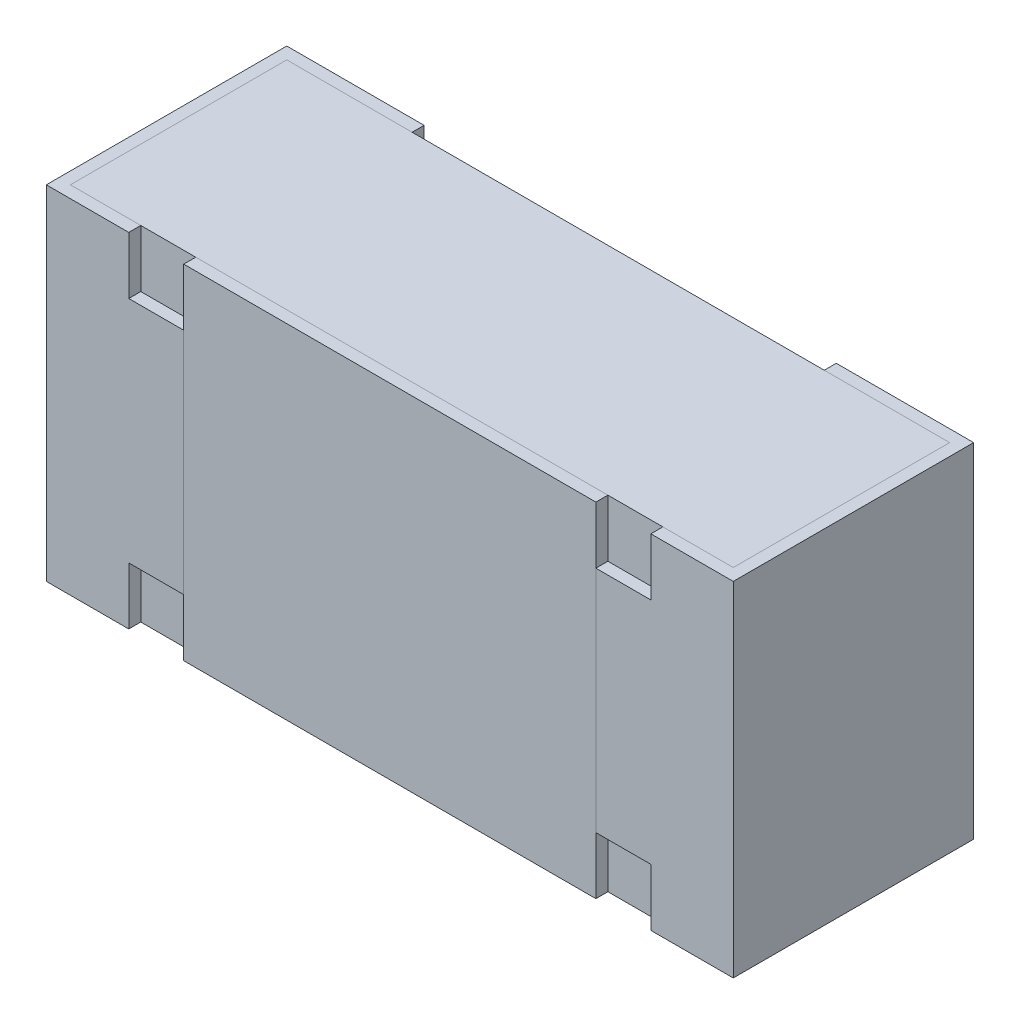
ISO-10303-21;
HEADER;
FILE_DESCRIPTION(('STEP AP214'),'2;1');
FILE_NAME('part.step','',(''),(''),'','','');
FILE_SCHEMA(('AUTOMOTIVE_DESIGN { 1 0 10303 214 1 1 1 1 }'));
ENDSEC;
DATA;
#1=APPLICATION_CONTEXT('core data for automotive mechanical design processes');
#2=APPLICATION_PROTOCOL_DEFINITION('international standard','automotive_design',2000,#1);
#3=PRODUCT_CONTEXT('',#1,'mechanical');
#4=PRODUCT('Part','Part','',(#3));
#5=PRODUCT_RELATED_PRODUCT_CATEGORY('part','',(#4));
#6=PRODUCT_DEFINITION_FORMATION('','',#4);
#7=PRODUCT_DEFINITION_CONTEXT('part definition',#1,'design');
#8=PRODUCT_DEFINITION('design','',#6,#7);
#9=PRODUCT_DEFINITION_SHAPE('','',#8);
#10=(LENGTH_UNIT() NAMED_UNIT(*) SI_UNIT(.MILLI.,.METRE.));
#11=(NAMED_UNIT(*) PLANE_ANGLE_UNIT() SI_UNIT($,.RADIAN.));
#12=(NAMED_UNIT(*) SI_UNIT($,.STERADIAN.) SOLID_ANGLE_UNIT());
#13=UNCERTAINTY_MEASURE_WITH_UNIT(LENGTH_MEASURE(1.E-05),#10,'distance_accuracy_value','');
#14=(GEOMETRIC_REPRESENTATION_CONTEXT(3) GLOBAL_UNCERTAINTY_ASSIGNED_CONTEXT((#13)) GLOBAL_UNIT_ASSIGNED_CONTEXT((#10,
#11,#12)) REPRESENTATION_CONTEXT('',''));
#15=CARTESIAN_POINT('',(0.,0.,0.));
#16=DIRECTION('',(0.,0.,1.));
#17=DIRECTION('',(1.,0.,0.));
#18=AXIS2_PLACEMENT_3D('',#15,#16,#17);
#19=CARTESIAN_POINT('',(0.000116839999999969,-0.24995428,0.01278128));
#20=DIRECTION('',(0.,-1.,0.));
#21=DIRECTION('',(1.,0.,0.));
#22=AXIS2_PLACEMENT_3D('',#19,#20,#21);
#23=PLANE('',#22);
#24=DIRECTION('',(0.,0.,-1.));
#25=VECTOR('',#24,1.);
#26=CARTESIAN_POINT('',(0.48261684,-0.24995428,0.03028128));
#27=LINE('',#26,#25);
#28=CARTESIAN_POINT('',(0.48261684,-0.24995428,0.34528128));
#29=VERTEX_POINT('',#28);
#30=CARTESIAN_POINT('',(0.48261684,-0.24995428,0.03028128));
#31=VERTEX_POINT('',#30);
#32=EDGE_CURVE('P0_E10',#29,#31,#27,.T.);
#33=ORIENTED_EDGE('',*,*,#32,.F.);
#34=DIRECTION('',(1.,0.,0.));
#35=VECTOR('',#34,1.);
#36=CARTESIAN_POINT('',(0.48261684,-0.24995428,0.34528128));
#37=LINE('',#36,#35);
#38=CARTESIAN_POINT('',(-0.48238316,-0.24995428,0.34528128));
#39=VERTEX_POINT('',#38);
#40=EDGE_CURVE('P0_E23',#39,#29,#37,.T.);
#41=ORIENTED_EDGE('',*,*,#40,.F.);
#42=DIRECTION('',(0.,0.,1.));
#43=VECTOR('',#42,1.);
#44=CARTESIAN_POINT('',(-0.48238316,-0.24995428,0.03028128));
#45=LINE('',#44,#43);
#46=CARTESIAN_POINT('',(-0.48238316,-0.24995428,0.03028128));
#47=VERTEX_POINT('',#46);
#48=EDGE_CURVE('P0_E69',#47,#39,#45,.T.);
#49=ORIENTED_EDGE('',*,*,#48,.F.);
#50=DIRECTION('',(-1.,0.,0.));
#51=VECTOR('',#50,1.);
#52=CARTESIAN_POINT('',(0.48261684,-0.24995428,0.03028128));
#53=LINE('',#52,#51);
#54=EDGE_CURVE('P0_E83',#31,#47,#53,.T.);
#55=ORIENTED_EDGE('',*,*,#54,.F.);
#56=EDGE_LOOP('',(#33,#41,#49,#55));
#57=FACE_BOUND('',#56,.T.);
#58=ADVANCED_FACE('P0_F16',(#57),#23,.T.);
#59=CARTESIAN_POINT('',(0.000116840000000031,0.25004572,0.01278128));
#60=DIRECTION('',(0.,-1.,0.));
#61=DIRECTION('',(1.,0.,0.));
#62=AXIS2_PLACEMENT_3D('',#59,#60,#61);
#63=PLANE('',#62);
#64=DIRECTION('',(0.,0.,-1.));
#65=VECTOR('',#64,1.);
#66=CARTESIAN_POINT('',(0.48261684,0.25004572,0.03028128));
#67=LINE('',#66,#65);
#68=CARTESIAN_POINT('',(0.48261684,0.25004572,0.34528128));
#69=VERTEX_POINT('',#68);
#70=CARTESIAN_POINT('',(0.48261684,0.25004572,0.03028128));
#71=VERTEX_POINT('',#70);
#72=EDGE_CURVE('P0_E81',#69,#71,#67,.T.);
#73=ORIENTED_EDGE('',*,*,#72,.T.);
#74=DIRECTION('',(-1.,0.,0.));
#75=VECTOR('',#74,1.);
#76=CARTESIAN_POINT('',(0.48261684,0.25004572,0.03028128));
#77=LINE('',#76,#75);
#78=CARTESIAN_POINT('',(-0.48238316,0.25004572,0.03028128));
#79=VERTEX_POINT('',#78);
#80=EDGE_CURVE('P0_E60',#71,#79,#77,.T.);
#81=ORIENTED_EDGE('',*,*,#80,.T.);
#82=DIRECTION('',(0.,0.,1.));
#83=VECTOR('',#82,1.);
#84=CARTESIAN_POINT('',(-0.48238316,0.25004572,0.03028128));
#85=LINE('',#84,#83);
#86=CARTESIAN_POINT('',(-0.48238316,0.25004572,0.34528128));
#87=VERTEX_POINT('',#86);
#88=EDGE_CURVE('P0_E54',#79,#87,#85,.T.);
#89=ORIENTED_EDGE('',*,*,#88,.T.);
#90=DIRECTION('',(1.,0.,0.));
#91=VECTOR('',#90,1.);
#92=CARTESIAN_POINT('',(0.48261684,0.25004572,0.34528128));
#93=LINE('',#92,#91);
#94=EDGE_CURVE('P0_E58',#87,#69,#93,.T.);
#95=ORIENTED_EDGE('',*,*,#94,.T.);
#96=EDGE_LOOP('',(#73,#81,#89,#95));
#97=FACE_BOUND('',#96,.T.);
#98=ADVANCED_FACE('P0_F56',(#97),#63,.F.);
#99=CARTESIAN_POINT('',(0.48261684,-1.26506511138739,0.0302812799999999));
#100=DIRECTION('',(0.,0.,-1.));
#101=DIRECTION('',(-1.,0.,0.));
#102=AXIS2_PLACEMENT_3D('',#99,#100,#101);
#103=PLANE('',#102);
#104=DIRECTION('',(0.,1.,0.));
#105=VECTOR('',#104,1.);
#106=CARTESIAN_POINT('',(0.48261684,-1.26506511138739,0.0302812799999999));
#107=LINE('',#106,#105);
#108=EDGE_CURVE('P0_E75',#31,#71,#107,.T.);
#109=ORIENTED_EDGE('',*,*,#108,.F.);
#110=ORIENTED_EDGE('',*,*,#54,.T.);
#111=DIRECTION('',(0.,1.,0.));
#112=VECTOR('',#111,1.);
#113=CARTESIAN_POINT('',(-0.48238316,-1.26506511138739,0.0302812799999999));
#114=LINE('',#113,#112);
#115=EDGE_CURVE('P0_E70',#47,#79,#114,.T.);
#116=ORIENTED_EDGE('',*,*,#115,.T.);
#117=ORIENTED_EDGE('',*,*,#80,.F.);
#118=EDGE_LOOP('',(#109,#110,#116,#117));
#119=FACE_BOUND('',#118,.T.);
#120=ADVANCED_FACE('P0_F87',(#119),#103,.T.);
#121=CARTESIAN_POINT('',(-0.48238316,-1.26506511138739,0.0302812799999999));
#122=DIRECTION('',(-1.,0.,0.));
#123=DIRECTION('',(0.,-1.,0.));
#124=AXIS2_PLACEMENT_3D('',#121,#122,#123);
#125=PLANE('',#124);
#126=ORIENTED_EDGE('',*,*,#115,.F.);
#127=ORIENTED_EDGE('',*,*,#48,.T.);
#128=DIRECTION('',(0.,1.,0.));
#129=VECTOR('',#128,1.);
#130=CARTESIAN_POINT('',(-0.48238316,-1.26506511138739,0.34528128));
#131=LINE('',#130,#129);
#132=EDGE_CURVE('P0_E66',#39,#87,#131,.T.);
#133=ORIENTED_EDGE('',*,*,#132,.T.);
#134=ORIENTED_EDGE('',*,*,#88,.F.);
#135=EDGE_LOOP('',(#126,#127,#133,#134));
#136=FACE_BOUND('',#135,.T.);
#137=ADVANCED_FACE('P0_F67',(#136),#125,.T.);
#138=CARTESIAN_POINT('',(0.48261684,-1.26506511138739,0.34528128));
#139=DIRECTION('',(0.,0.,1.));
#140=DIRECTION('',(0.,1.,0.));
#141=AXIS2_PLACEMENT_3D('',#138,#139,#140);
#142=PLANE('',#141);
#143=ORIENTED_EDGE('',*,*,#132,.F.);
#144=ORIENTED_EDGE('',*,*,#40,.T.);
#145=DIRECTION('',(0.,1.,0.));
#146=VECTOR('',#145,1.);
#147=CARTESIAN_POINT('',(0.48261684,-1.26506511138739,0.34528128));
#148=LINE('',#147,#146);
#149=EDGE_CURVE('P0_E71',#29,#69,#148,.T.);
#150=ORIENTED_EDGE('',*,*,#149,.T.);
#151=ORIENTED_EDGE('',*,*,#94,.F.);
#152=EDGE_LOOP('',(#143,#144,#150,#151));
#153=FACE_BOUND('',#152,.T.);
#154=ADVANCED_FACE('P0_F73',(#153),#142,.T.);
#155=CARTESIAN_POINT('',(0.48261684,-1.26506511138739,0.0302812799999999));
#156=DIRECTION('',(1.,0.,0.));
#157=DIRECTION('',(0.,0.,-1.));
#158=AXIS2_PLACEMENT_3D('',#155,#156,#157);
#159=PLANE('',#158);
#160=ORIENTED_EDGE('',*,*,#149,.F.);
#161=ORIENTED_EDGE('',*,*,#32,.T.);
#162=ORIENTED_EDGE('',*,*,#108,.T.);
#163=ORIENTED_EDGE('',*,*,#72,.F.);
#164=EDGE_LOOP('',(#160,#161,#162,#163));
#165=FACE_BOUND('',#164,.T.);
#166=ADVANCED_FACE('P0_F90',(#165),#159,.T.);
#167=CLOSED_SHELL('',(#58,#98,#120,#137,#154,#166));
#168=MANIFOLD_SOLID_BREP('P0_B1',#167);
#169=CARTESIAN_POINT('',(0.30011684,-0.24995428,-0.435743687590665));
#170=DIRECTION('',(1.,0.,0.));
#171=DIRECTION('',(0.,1.,0.));
#172=AXIS2_PLACEMENT_3D('',#169,#170,#171);
#173=PLANE('',#172);
#174=DIRECTION('',(0.,-1.,0.));
#175=VECTOR('',#174,1.);
#176=CARTESIAN_POINT('',(0.30011684,-0.24995428,0.34528128));
#177=LINE('',#176,#175);
#178=CARTESIAN_POINT('',(0.30011684,0.25004572,0.34528128));
#179=VERTEX_POINT('',#178);
#180=CARTESIAN_POINT('',(0.30011684,-0.24995428,0.34528128));
#181=VERTEX_POINT('',#180);
#182=EDGE_CURVE('P1_E11',#179,#181,#177,.T.);
#183=ORIENTED_EDGE('',*,*,#182,.F.);
#184=DIRECTION('',(0.,0.,1.));
#185=VECTOR('',#184,1.);
#186=CARTESIAN_POINT('',(0.30011684,0.25004572,-0.435743687590665));
#187=LINE('',#186,#185);
#188=CARTESIAN_POINT('',(0.30011684,0.25004572,0.36278128));
#189=VERTEX_POINT('',#188);
#190=EDGE_CURVE('P1_E24',#179,#189,#187,.T.);
#191=ORIENTED_EDGE('',*,*,#190,.T.);
#192=DIRECTION('',(0.,1.,0.));
#193=VECTOR('',#192,1.);
#194=CARTESIAN_POINT('',(0.30011684,-0.24995428,0.36278128));
#195=LINE('',#194,#193);
#196=CARTESIAN_POINT('',(0.30011684,-0.24995428,0.36278128));
#197=VERTEX_POINT('',#196);
#198=EDGE_CURVE('P1_E76',#197,#189,#195,.T.);
#199=ORIENTED_EDGE('',*,*,#198,.F.);
#200=DIRECTION('',(0.,0.,1.));
#201=VECTOR('',#200,1.);
#202=CARTESIAN_POINT('',(0.30011684,-0.24995428,-0.435743687590665));
#203=LINE('',#202,#201);
#204=EDGE_CURVE('P1_E86',#181,#197,#203,.T.);
#205=ORIENTED_EDGE('',*,*,#204,.F.);
#206=EDGE_LOOP('',(#183,#191,#199,#205));
#207=FACE_BOUND('',#206,.T.);
#208=ADVANCED_FACE('P1_F17',(#207),#173,.T.);
#209=CARTESIAN_POINT('',(0.30011684,-0.24995428,-0.435743687590665));
#210=DIRECTION('',(0.,-1.,0.));
#211=DIRECTION('',(1.,0.,0.));
#212=AXIS2_PLACEMENT_3D('',#209,#210,#211);
#213=PLANE('',#212);
#214=DIRECTION('',(-1.,0.,0.));
#215=VECTOR('',#214,1.);
#216=CARTESIAN_POINT('',(0.30011684,-0.24995428,0.34528128));
#217=LINE('',#216,#215);
#218=CARTESIAN_POINT('',(-0.29988316,-0.24995428,0.34528128));
#219=VERTEX_POINT('',#218);
#220=EDGE_CURVE('P1_E84',#181,#219,#217,.T.);
#221=ORIENTED_EDGE('',*,*,#220,.F.);
#222=ORIENTED_EDGE('',*,*,#204,.T.);
#223=DIRECTION('',(1.,0.,0.));
#224=VECTOR('',#223,1.);
#225=CARTESIAN_POINT('',(0.30011684,-0.24995428,0.36278128));
#226=LINE('',#225,#224);
#227=CARTESIAN_POINT('',(-0.29988316,-0.24995428,0.36278128));
#228=VERTEX_POINT('',#227);
#229=EDGE_CURVE('P1_E82',#228,#197,#226,.T.);
#230=ORIENTED_EDGE('',*,*,#229,.F.);
#231=DIRECTION('',(0.,0.,1.));
#232=VECTOR('',#231,1.);
#233=CARTESIAN_POINT('',(-0.29988316,-0.24995428,-0.435743687590665));
#234=LINE('',#233,#232);
#235=EDGE_CURVE('P1_E67',#219,#228,#234,.T.);
#236=ORIENTED_EDGE('',*,*,#235,.F.);
#237=EDGE_LOOP('',(#221,#222,#230,#236));
#238=FACE_BOUND('',#237,.T.);
#239=ADVANCED_FACE('P1_F91',(#238),#213,.T.);
#240=CARTESIAN_POINT('',(-0.29988316,-0.24995428,-0.435743687590665));
#241=DIRECTION('',(-1.,0.,0.));
#242=DIRECTION('',(0.,-1.,0.));
#243=AXIS2_PLACEMENT_3D('',#240,#241,#242);
#244=PLANE('',#243);
#245=DIRECTION('',(0.,1.,0.));
#246=VECTOR('',#245,1.);
#247=CARTESIAN_POINT('',(-0.29988316,-0.24995428,0.34528128));
#248=LINE('',#247,#246);
#249=CARTESIAN_POINT('',(-0.29988316,0.25004572,0.34528128));
#250=VERTEX_POINT('',#249);
#251=EDGE_CURVE('P1_E71',#219,#250,#248,.T.);
#252=ORIENTED_EDGE('',*,*,#251,.F.);
#253=ORIENTED_EDGE('',*,*,#235,.T.);
#254=DIRECTION('',(0.,-1.,0.));
#255=VECTOR('',#254,1.);
#256=CARTESIAN_POINT('',(-0.29988316,-0.24995428,0.36278128));
#257=LINE('',#256,#255);
#258=CARTESIAN_POINT('',(-0.29988316,0.25004572,0.36278128));
#259=VERTEX_POINT('',#258);
#260=EDGE_CURVE('P1_E63',#259,#228,#257,.T.);
#261=ORIENTED_EDGE('',*,*,#260,.F.);
#262=DIRECTION('',(0.,0.,1.));
#263=VECTOR('',#262,1.);
#264=CARTESIAN_POINT('',(-0.29988316,0.25004572,-0.435743687590665));
#265=LINE('',#264,#263);
#266=EDGE_CURVE('P1_E55',#250,#259,#265,.T.);
#267=ORIENTED_EDGE('',*,*,#266,.F.);
#268=EDGE_LOOP('',(#252,#253,#261,#267));
#269=FACE_BOUND('',#268,.T.);
#270=ADVANCED_FACE('P1_F66',(#269),#244,.T.);
#271=CARTESIAN_POINT('',(0.30011684,0.25004572,-0.435743687590665));
#272=DIRECTION('',(0.,1.,0.));
#273=DIRECTION('',(-1.,0.,0.));
#274=AXIS2_PLACEMENT_3D('',#271,#272,#273);
#275=PLANE('',#274);
#276=DIRECTION('',(1.,0.,0.));
#277=VECTOR('',#276,1.);
#278=CARTESIAN_POINT('',(0.30011684,0.25004572,0.34528128));
#279=LINE('',#278,#277);
#280=EDGE_CURVE('P1_E60',#250,#179,#279,.T.);
#281=ORIENTED_EDGE('',*,*,#280,.F.);
#282=ORIENTED_EDGE('',*,*,#266,.T.);
#283=DIRECTION('',(-1.,0.,0.));
#284=VECTOR('',#283,1.);
#285=CARTESIAN_POINT('',(0.30011684,0.25004572,0.36278128));
#286=LINE('',#285,#284);
#287=EDGE_CURVE('P1_E59',#189,#259,#286,.T.);
#288=ORIENTED_EDGE('',*,*,#287,.F.);
#289=ORIENTED_EDGE('',*,*,#190,.F.);
#290=EDGE_LOOP('',(#281,#282,#288,#289));
#291=FACE_BOUND('',#290,.T.);
#292=ADVANCED_FACE('P1_F57',(#291),#275,.T.);
#293=CARTESIAN_POINT('',(0.000116839999999937,4.57199999999786E-05,0.36278128));
#294=DIRECTION('',(0.,0.,1.));
#295=DIRECTION('',(1.,0.,0.));
#296=AXIS2_PLACEMENT_3D('',#293,#294,#295);
#297=PLANE('',#296);
#298=ORIENTED_EDGE('',*,*,#198,.T.);
#299=ORIENTED_EDGE('',*,*,#287,.T.);
#300=ORIENTED_EDGE('',*,*,#260,.T.);
#301=ORIENTED_EDGE('',*,*,#229,.T.);
#302=EDGE_LOOP('',(#298,#299,#300,#301));
#303=FACE_BOUND('',#302,.T.);
#304=ADVANCED_FACE('P1_F74',(#303),#297,.T.);
#305=CARTESIAN_POINT('',(0.48261684,-1.26506511138739,0.34528128));
#306=DIRECTION('',(0.,0.,1.));
#307=DIRECTION('',(0.,1.,0.));
#308=AXIS2_PLACEMENT_3D('',#305,#306,#307);
#309=PLANE('',#308);
#310=ORIENTED_EDGE('',*,*,#182,.T.);
#311=ORIENTED_EDGE('',*,*,#220,.T.);
#312=ORIENTED_EDGE('',*,*,#251,.T.);
#313=ORIENTED_EDGE('',*,*,#280,.T.);
#314=EDGE_LOOP('',(#310,#311,#312,#313));
#315=FACE_BOUND('',#314,.T.);
#316=ADVANCED_FACE('P1_F88',(#315),#309,.F.);
#317=CLOSED_SHELL('',(#208,#239,#270,#292,#304,#316));
#318=MANIFOLD_SOLID_BREP('P1_B1',#317);
#319=CARTESIAN_POINT('',(0.30011684,0.25004572,0.03028128));
#320=DIRECTION('',(1.,0.,0.));
#321=DIRECTION('',(0.,1.,0.));
#322=AXIS2_PLACEMENT_3D('',#319,#320,#321);
#323=PLANE('',#322);
#324=DIRECTION('',(0.,0.,1.));
#325=VECTOR('',#324,1.);
#326=CARTESIAN_POINT('',(0.30011684,-0.24995428,0.03028128));
#327=LINE('',#326,#325);
#328=CARTESIAN_POINT('',(0.30011684,-0.24995428,0.01278128));
#329=VERTEX_POINT('',#328);
#330=CARTESIAN_POINT('',(0.30011684,-0.24995428,0.03028128));
#331=VERTEX_POINT('',#330);
#332=EDGE_CURVE('P2_E11',#329,#331,#327,.T.);
#333=ORIENTED_EDGE('',*,*,#332,.T.);
#334=DIRECTION('',(0.,-1.,0.));
#335=VECTOR('',#334,1.);
#336=CARTESIAN_POINT('',(0.30011684,0.25004572,0.03028128));
#337=LINE('',#336,#335);
#338=CARTESIAN_POINT('',(0.30011684,0.25004572,0.03028128));
#339=VERTEX_POINT('',#338);
#340=EDGE_CURVE('P2_E24',#339,#331,#337,.T.);
#341=ORIENTED_EDGE('',*,*,#340,.F.);
#342=DIRECTION('',(0.,0.,1.));
#343=VECTOR('',#342,1.);
#344=CARTESIAN_POINT('',(0.30011684,0.25004572,0.03028128));
#345=LINE('',#344,#343);
#346=CARTESIAN_POINT('',(0.30011684,0.25004572,0.01278128));
#347=VERTEX_POINT('',#346);
#348=EDGE_CURVE('P2_E189',#347,#339,#345,.T.);
#349=ORIENTED_EDGE('',*,*,#348,.F.);
#350=DIRECTION('',(0.,-1.,0.));
#351=VECTOR('',#350,1.);
#352=CARTESIAN_POINT('',(0.30011684,0.25004572,0.01278128));
#353=LINE('',#352,#351);
#354=EDGE_CURVE('P2_E109',#347,#329,#353,.T.);
#355=ORIENTED_EDGE('',*,*,#354,.T.);
#356=EDGE_LOOP('',(#333,#341,#349,#355));
#357=FACE_BOUND('',#356,.T.);
#358=ADVANCED_FACE('P2_F17',(#357),#323,.F.);
#359=CARTESIAN_POINT('',(0.30011684,0.25004572,0.03028128));
#360=DIRECTION('',(0.,0.,-1.));
#361=DIRECTION('',(-1.,0.,0.));
#362=AXIS2_PLACEMENT_3D('',#359,#360,#361);
#363=PLANE('',#362);
#364=DIRECTION('',(1.,0.,0.));
#365=VECTOR('',#364,1.);
#366=CARTESIAN_POINT('',(0.30011684,-0.24995428,0.03028128));
#367=LINE('',#366,#365);
#368=CARTESIAN_POINT('',(0.48261684,-0.24995428,0.03028128));
#369=VERTEX_POINT('',#368);
#370=EDGE_CURVE('P2_E186',#331,#369,#367,.T.);
#371=ORIENTED_EDGE('',*,*,#370,.T.);
#372=DIRECTION('',(0.,-1.,0.));
#373=VECTOR('',#372,1.);
#374=CARTESIAN_POINT('',(0.48261684,0.25004572,0.03028128));
#375=LINE('',#374,#373);
#376=CARTESIAN_POINT('',(0.48261684,0.25004572,0.03028128));
#377=VERTEX_POINT('',#376);
#378=EDGE_CURVE('P2_E183',#377,#369,#375,.T.);
#379=ORIENTED_EDGE('',*,*,#378,.F.);
#380=DIRECTION('',(1.,0.,0.));
#381=VECTOR('',#380,1.);
#382=CARTESIAN_POINT('',(0.30011684,0.25004572,0.03028128));
#383=LINE('',#382,#381);
#384=EDGE_CURVE('P2_E180',#339,#377,#383,.T.);
#385=ORIENTED_EDGE('',*,*,#384,.F.);
#386=ORIENTED_EDGE('',*,*,#340,.T.);
#387=EDGE_LOOP('',(#371,#379,#385,#386));
#388=FACE_BOUND('',#387,.T.);
#389=ADVANCED_FACE('P2_F192',(#388),#363,.F.);
#390=CARTESIAN_POINT('',(0.48261684,0.25004572,0.03028128));
#391=DIRECTION('',(1.,0.,0.));
#392=DIRECTION('',(0.,1.,0.));
#393=AXIS2_PLACEMENT_3D('',#390,#391,#392);
#394=PLANE('',#393);
#395=DIRECTION('',(0.,0.,1.));
#396=VECTOR('',#395,1.);
#397=CARTESIAN_POINT('',(0.48261684,-0.24995428,0.03028128));
#398=LINE('',#397,#396);
#399=CARTESIAN_POINT('',(0.48261684,-0.24995428,0.34528128));
#400=VERTEX_POINT('',#399);
#401=EDGE_CURVE('P2_E178',#369,#400,#398,.T.);
#402=ORIENTED_EDGE('',*,*,#401,.T.);
#403=DIRECTION('',(0.,-1.,0.));
#404=VECTOR('',#403,1.);
#405=CARTESIAN_POINT('',(0.48261684,0.25004572,0.34528128));
#406=LINE('',#405,#404);
#407=CARTESIAN_POINT('',(0.48261684,0.25004572,0.34528128));
#408=VERTEX_POINT('',#407);
#409=EDGE_CURVE('P2_E175',#408,#400,#406,.T.);
#410=ORIENTED_EDGE('',*,*,#409,.F.);
#411=DIRECTION('',(0.,0.,1.));
#412=VECTOR('',#411,1.);
#413=CARTESIAN_POINT('',(0.48261684,0.25004572,0.03028128));
#414=LINE('',#413,#412);
#415=EDGE_CURVE('P2_E173',#377,#408,#414,.T.);
#416=ORIENTED_EDGE('',*,*,#415,.F.);
#417=ORIENTED_EDGE('',*,*,#378,.T.);
#418=EDGE_LOOP('',(#402,#410,#416,#417));
#419=FACE_BOUND('',#418,.T.);
#420=ADVANCED_FACE('P2_F200',(#419),#394,.F.);
#421=CARTESIAN_POINT('',(0.48261684,0.25004572,0.34528128));
#422=DIRECTION('',(0.,0.,1.));
#423=DIRECTION('',(0.,1.,0.));
#424=AXIS2_PLACEMENT_3D('',#421,#422,#423);
#425=PLANE('',#424);
#426=DIRECTION('',(1.,0.,0.));
#427=VECTOR('',#426,1.);
#428=CARTESIAN_POINT('',(0.30011684,0.166712386666667,0.34528128));
#429=LINE('',#428,#427);
#430=CARTESIAN_POINT('',(0.30011684,0.166712386666667,0.34528128));
#431=VERTEX_POINT('',#430);
#432=CARTESIAN_POINT('',(0.38011684,0.166712386666667,0.34528128));
#433=VERTEX_POINT('',#432);
#434=EDGE_CURVE('P2_E171',#431,#433,#429,.T.);
#435=ORIENTED_EDGE('',*,*,#434,.T.);
#436=DIRECTION('',(0.,1.,0.));
#437=VECTOR('',#436,1.);
#438=CARTESIAN_POINT('',(0.38011684,0.25004572,0.34528128));
#439=LINE('',#438,#437);
#440=CARTESIAN_POINT('',(0.38011684,0.25004572,0.34528128));
#441=VERTEX_POINT('',#440);
#442=EDGE_CURVE('P2_E168',#433,#441,#439,.T.);
#443=ORIENTED_EDGE('',*,*,#442,.T.);
#444=DIRECTION('',(-1.,0.,0.));
#445=VECTOR('',#444,1.);
#446=CARTESIAN_POINT('',(0.48261684,0.25004572,0.34528128));
#447=LINE('',#446,#445);
#448=EDGE_CURVE('P2_E166',#408,#441,#447,.T.);
#449=ORIENTED_EDGE('',*,*,#448,.F.);
#450=ORIENTED_EDGE('',*,*,#409,.T.);
#451=DIRECTION('',(-1.,0.,0.));
#452=VECTOR('',#451,1.);
#453=CARTESIAN_POINT('',(0.48261684,-0.24995428,0.34528128));
#454=LINE('',#453,#452);
#455=CARTESIAN_POINT('',(0.38011684,-0.24995428,0.34528128));
#456=VERTEX_POINT('',#455);
#457=EDGE_CURVE('P2_E164',#400,#456,#454,.T.);
#458=ORIENTED_EDGE('',*,*,#457,.T.);
#459=DIRECTION('',(0.,1.,0.));
#460=VECTOR('',#459,1.);
#461=CARTESIAN_POINT('',(0.38011684,-0.24995428,0.34528128));
#462=LINE('',#461,#460);
#463=CARTESIAN_POINT('',(0.38011684,-0.166620946666667,0.34528128));
#464=VERTEX_POINT('',#463);
#465=EDGE_CURVE('P2_E161',#456,#464,#462,.T.);
#466=ORIENTED_EDGE('',*,*,#465,.T.);
#467=DIRECTION('',(-1.,0.,0.));
#468=VECTOR('',#467,1.);
#469=CARTESIAN_POINT('',(0.30011684,-0.166620946666667,0.34528128));
#470=LINE('',#469,#468);
#471=CARTESIAN_POINT('',(0.30011684,-0.166620946666667,0.34528128));
#472=VERTEX_POINT('',#471);
#473=EDGE_CURVE('P2_E158',#464,#472,#470,.T.);
#474=ORIENTED_EDGE('',*,*,#473,.T.);
#475=DIRECTION('',(0.,-1.,0.));
#476=VECTOR('',#475,1.);
#477=CARTESIAN_POINT('',(0.30011684,0.25004572,0.34528128));
#478=LINE('',#477,#476);
#479=EDGE_CURVE('P2_E155',#431,#472,#478,.T.);
#480=ORIENTED_EDGE('',*,*,#479,.F.);
#481=EDGE_LOOP('',(#435,#443,#449,#450,#458,#466,#474,#480));
#482=FACE_BOUND('',#481,.T.);
#483=ADVANCED_FACE('P2_F228',(#482),#425,.F.);
#484=CARTESIAN_POINT('',(0.30011684,0.25004572,0.36278128));
#485=DIRECTION('',(1.,0.,0.));
#486=DIRECTION('',(0.,1.,0.));
#487=AXIS2_PLACEMENT_3D('',#484,#485,#486);
#488=PLANE('',#487);
#489=DIRECTION('',(0.,-1.,0.));
#490=VECTOR('',#489,1.);
#491=CARTESIAN_POINT('',(0.30011684,0.25004572,0.36278128));
#492=LINE('',#491,#490);
#493=CARTESIAN_POINT('',(0.30011684,0.166712386666667,0.36278128));
#494=VERTEX_POINT('',#493);
#495=CARTESIAN_POINT('',(0.30011684,-0.166620946666667,0.36278128));
#496=VERTEX_POINT('',#495);
#497=EDGE_CURVE('P2_E152',#494,#496,#492,.T.);
#498=ORIENTED_EDGE('',*,*,#497,.F.);
#499=DIRECTION('',(0.,0.,1.));
#500=VECTOR('',#499,1.);
#501=CARTESIAN_POINT('',(0.30011684,0.166712386666667,0.34528128));
#502=LINE('',#501,#500);
#503=EDGE_CURVE('P2_E150',#431,#494,#502,.T.);
#504=ORIENTED_EDGE('',*,*,#503,.F.);
#505=ORIENTED_EDGE('',*,*,#479,.T.);
#506=DIRECTION('',(0.,0.,1.));
#507=VECTOR('',#506,1.);
#508=CARTESIAN_POINT('',(0.30011684,-0.166620946666667,0.34528128));
#509=LINE('',#508,#507);
#510=EDGE_CURVE('P2_E147',#472,#496,#509,.T.);
#511=ORIENTED_EDGE('',*,*,#510,.T.);
#512=EDGE_LOOP('',(#498,#504,#505,#511));
#513=FACE_BOUND('',#512,.T.);
#514=ADVANCED_FACE('P2_F232',(#513),#488,.F.);
#515=CARTESIAN_POINT('',(0.50011684,0.25004572,0.36278128));
#516=DIRECTION('',(0.,0.,-1.));
#517=DIRECTION('',(0.,-1.,0.));
#518=AXIS2_PLACEMENT_3D('',#515,#516,#517);
#519=PLANE('',#518);
#520=DIRECTION('',(1.,0.,0.));
#521=VECTOR('',#520,1.);
#522=CARTESIAN_POINT('',(0.50011684,0.25004572,0.36278128));
#523=LINE('',#522,#521);
#524=CARTESIAN_POINT('',(0.38011684,0.25004572,0.36278128));
#525=VERTEX_POINT('',#524);
#526=CARTESIAN_POINT('',(0.50011684,0.25004572,0.36278128));
#527=VERTEX_POINT('',#526);
#528=EDGE_CURVE('P2_E125',#525,#527,#523,.T.);
#529=ORIENTED_EDGE('',*,*,#528,.F.);
#530=DIRECTION('',(0.,1.,0.));
#531=VECTOR('',#530,1.);
#532=CARTESIAN_POINT('',(0.38011684,0.25004572,0.36278128));
#533=LINE('',#532,#531);
#534=CARTESIAN_POINT('',(0.38011684,0.166712386666667,0.36278128));
#535=VERTEX_POINT('',#534);
#536=EDGE_CURVE('P2_E143',#535,#525,#533,.T.);
#537=ORIENTED_EDGE('',*,*,#536,.F.);
#538=DIRECTION('',(1.,0.,0.));
#539=VECTOR('',#538,1.);
#540=CARTESIAN_POINT('',(0.30011684,0.166712386666667,0.36278128));
#541=LINE('',#540,#539);
#542=EDGE_CURVE('P2_E141',#494,#535,#541,.T.);
#543=ORIENTED_EDGE('',*,*,#542,.F.);
#544=ORIENTED_EDGE('',*,*,#497,.T.);
#545=DIRECTION('',(-1.,0.,0.));
#546=VECTOR('',#545,1.);
#547=CARTESIAN_POINT('',(0.30011684,-0.166620946666667,0.36278128));
#548=LINE('',#547,#546);
#549=CARTESIAN_POINT('',(0.38011684,-0.166620946666667,0.36278128));
#550=VERTEX_POINT('',#549);
#551=EDGE_CURVE('P2_E139',#550,#496,#548,.T.);
#552=ORIENTED_EDGE('',*,*,#551,.F.);
#553=DIRECTION('',(0.,1.,0.));
#554=VECTOR('',#553,1.);
#555=CARTESIAN_POINT('',(0.38011684,-0.24995428,0.36278128));
#556=LINE('',#555,#554);
#557=CARTESIAN_POINT('',(0.38011684,-0.24995428,0.36278128));
#558=VERTEX_POINT('',#557);
#559=EDGE_CURVE('P2_E136',#558,#550,#556,.T.);
#560=ORIENTED_EDGE('',*,*,#559,.F.);
#561=DIRECTION('',(1.,0.,0.));
#562=VECTOR('',#561,1.);
#563=CARTESIAN_POINT('',(0.50011684,-0.24995428,0.36278128));
#564=LINE('',#563,#562);
#565=CARTESIAN_POINT('',(0.50011684,-0.24995428,0.36278128));
#566=VERTEX_POINT('',#565);
#567=EDGE_CURVE('P2_E133',#558,#566,#564,.T.);
#568=ORIENTED_EDGE('',*,*,#567,.T.);
#569=DIRECTION('',(0.,-1.,0.));
#570=VECTOR('',#569,1.);
#571=CARTESIAN_POINT('',(0.50011684,0.25004572,0.36278128));
#572=LINE('',#571,#570);
#573=EDGE_CURVE('P2_E131',#527,#566,#572,.T.);
#574=ORIENTED_EDGE('',*,*,#573,.F.);
#575=EDGE_LOOP('',(#529,#537,#543,#544,#552,#560,#568,#574));
#576=FACE_BOUND('',#575,.T.);
#577=ADVANCED_FACE('P2_F204',(#576),#519,.F.);
#578=CARTESIAN_POINT('',(0.50011684,0.25004572,0.01278128));
#579=DIRECTION('',(-1.,0.,0.));
#580=DIRECTION('',(0.,-1.,0.));
#581=AXIS2_PLACEMENT_3D('',#578,#579,#580);
#582=PLANE('',#581);
#583=DIRECTION('',(0.,0.,-1.));
#584=VECTOR('',#583,1.);
#585=CARTESIAN_POINT('',(0.50011684,-0.24995428,0.0127812799999999));
#586=LINE('',#585,#584);
#587=CARTESIAN_POINT('',(0.50011684,-0.24995428,0.0127812799999999));
#588=VERTEX_POINT('',#587);
#589=EDGE_CURVE('P2_E120',#566,#588,#586,.T.);
#590=ORIENTED_EDGE('',*,*,#589,.T.);
#591=DIRECTION('',(0.,-1.,0.));
#592=VECTOR('',#591,1.);
#593=CARTESIAN_POINT('',(0.50011684,0.25004572,0.01278128));
#594=LINE('',#593,#592);
#595=CARTESIAN_POINT('',(0.50011684,0.25004572,0.01278128));
#596=VERTEX_POINT('',#595);
#597=EDGE_CURVE('P2_E108',#596,#588,#594,.T.);
#598=ORIENTED_EDGE('',*,*,#597,.F.);
#599=DIRECTION('',(0.,0.,-1.));
#600=VECTOR('',#599,1.);
#601=CARTESIAN_POINT('',(0.50011684,0.25004572,0.01278128));
#602=LINE('',#601,#600);
#603=EDGE_CURVE('P2_E119',#527,#596,#602,.T.);
#604=ORIENTED_EDGE('',*,*,#603,.F.);
#605=ORIENTED_EDGE('',*,*,#573,.T.);
#606=EDGE_LOOP('',(#590,#598,#604,#605));
#607=FACE_BOUND('',#606,.T.);
#608=ADVANCED_FACE('P2_F117',(#607),#582,.F.);
#609=CARTESIAN_POINT('',(0.30011684,0.25004572,0.01278128));
#610=DIRECTION('',(0.,0.,1.));
#611=DIRECTION('',(1.,0.,0.));
#612=AXIS2_PLACEMENT_3D('',#609,#610,#611);
#613=PLANE('',#612);
#614=DIRECTION('',(-1.,0.,0.));
#615=VECTOR('',#614,1.);
#616=CARTESIAN_POINT('',(0.30011684,-0.24995428,0.01278128));
#617=LINE('',#616,#615);
#618=EDGE_CURVE('P2_E112',#588,#329,#617,.T.);
#619=ORIENTED_EDGE('',*,*,#618,.T.);
#620=ORIENTED_EDGE('',*,*,#354,.F.);
#621=DIRECTION('',(-1.,0.,0.));
#622=VECTOR('',#621,1.);
#623=CARTESIAN_POINT('',(0.30011684,0.25004572,0.01278128));
#624=LINE('',#623,#622);
#625=EDGE_CURVE('P2_E104',#596,#347,#624,.T.);
#626=ORIENTED_EDGE('',*,*,#625,.F.);
#627=ORIENTED_EDGE('',*,*,#597,.T.);
#628=EDGE_LOOP('',(#619,#620,#626,#627));
#629=FACE_BOUND('',#628,.T.);
#630=ADVANCED_FACE('P2_F107',(#629),#613,.F.);
#631=CARTESIAN_POINT('',(0.000116840000000031,0.25004572,0.01278128));
#632=DIRECTION('',(0.,-1.,0.));
#633=DIRECTION('',(1.,0.,0.));
#634=AXIS2_PLACEMENT_3D('',#631,#632,#633);
#635=PLANE('',#634);
#636=ORIENTED_EDGE('',*,*,#448,.T.);
#637=DIRECTION('',(0.,0.,1.));
#638=VECTOR('',#637,1.);
#639=CARTESIAN_POINT('',(0.38011684,0.25004572,0.34528128));
#640=LINE('',#639,#638);
#641=EDGE_CURVE('P2_E113',#441,#525,#640,.T.);
#642=ORIENTED_EDGE('',*,*,#641,.T.);
#643=ORIENTED_EDGE('',*,*,#528,.T.);
#644=ORIENTED_EDGE('',*,*,#603,.T.);
#645=ORIENTED_EDGE('',*,*,#625,.T.);
#646=ORIENTED_EDGE('',*,*,#348,.T.);
#647=ORIENTED_EDGE('',*,*,#384,.T.);
#648=ORIENTED_EDGE('',*,*,#415,.T.);
#649=EDGE_LOOP('',(#636,#642,#643,#644,#645,#646,#647,#648));
#650=FACE_BOUND('',#649,.T.);
#651=ADVANCED_FACE('P2_F123',(#650),#635,.F.);
#652=CARTESIAN_POINT('',(0.000116839999999969,-0.24995428,0.01278128));
#653=DIRECTION('',(0.,-1.,0.));
#654=DIRECTION('',(1.,0.,0.));
#655=AXIS2_PLACEMENT_3D('',#652,#653,#654);
#656=PLANE('',#655);
#657=DIRECTION('',(0.,0.,1.));
#658=VECTOR('',#657,1.);
#659=CARTESIAN_POINT('',(0.38011684,-0.24995428,0.34528128));
#660=LINE('',#659,#658);
#661=EDGE_CURVE('P2_E209',#456,#558,#660,.T.);
#662=ORIENTED_EDGE('',*,*,#661,.F.);
#663=ORIENTED_EDGE('',*,*,#457,.F.);
#664=ORIENTED_EDGE('',*,*,#401,.F.);
#665=ORIENTED_EDGE('',*,*,#370,.F.);
#666=ORIENTED_EDGE('',*,*,#332,.F.);
#667=ORIENTED_EDGE('',*,*,#618,.F.);
#668=ORIENTED_EDGE('',*,*,#589,.F.);
#669=ORIENTED_EDGE('',*,*,#567,.F.);
#670=EDGE_LOOP('',(#662,#663,#664,#665,#666,#667,#668,#669));
#671=FACE_BOUND('',#670,.T.);
#672=ADVANCED_FACE('P2_F196',(#671),#656,.T.);
#673=CARTESIAN_POINT('',(0.30011684,-0.166620946666667,0.34528128));
#674=DIRECTION('',(0.,1.,0.));
#675=DIRECTION('',(-1.,0.,0.));
#676=AXIS2_PLACEMENT_3D('',#673,#674,#675);
#677=PLANE('',#676);
#678=ORIENTED_EDGE('',*,*,#551,.T.);
#679=ORIENTED_EDGE('',*,*,#510,.F.);
#680=ORIENTED_EDGE('',*,*,#473,.F.);
#681=DIRECTION('',(0.,0.,1.));
#682=VECTOR('',#681,1.);
#683=CARTESIAN_POINT('',(0.38011684,-0.166620946666667,0.34528128));
#684=LINE('',#683,#682);
#685=EDGE_CURVE('P2_E211',#464,#550,#684,.T.);
#686=ORIENTED_EDGE('',*,*,#685,.T.);
#687=EDGE_LOOP('',(#678,#679,#680,#686));
#688=FACE_BOUND('',#687,.T.);
#689=ADVANCED_FACE('P2_F235',(#688),#677,.F.);
#690=CARTESIAN_POINT('',(0.38011684,-0.24995428,0.34528128));
#691=DIRECTION('',(1.,0.,0.));
#692=DIRECTION('',(0.,0.,-1.));
#693=AXIS2_PLACEMENT_3D('',#690,#691,#692);
#694=PLANE('',#693);
#695=ORIENTED_EDGE('',*,*,#559,.T.);
#696=ORIENTED_EDGE('',*,*,#685,.F.);
#697=ORIENTED_EDGE('',*,*,#465,.F.);
#698=ORIENTED_EDGE('',*,*,#661,.T.);
#699=EDGE_LOOP('',(#695,#696,#697,#698));
#700=FACE_BOUND('',#699,.T.);
#701=ADVANCED_FACE('P2_F210',(#700),#694,.F.);
#702=CARTESIAN_POINT('',(0.38011684,0.25004572,0.34528128));
#703=DIRECTION('',(1.,0.,0.));
#704=DIRECTION('',(0.,0.,-1.));
#705=AXIS2_PLACEMENT_3D('',#702,#703,#704);
#706=PLANE('',#705);
#707=ORIENTED_EDGE('',*,*,#536,.T.);
#708=ORIENTED_EDGE('',*,*,#641,.F.);
#709=ORIENTED_EDGE('',*,*,#442,.F.);
#710=DIRECTION('',(0.,0.,1.));
#711=VECTOR('',#710,1.);
#712=CARTESIAN_POINT('',(0.38011684,0.166712386666667,0.34528128));
#713=LINE('',#712,#711);
#714=EDGE_CURVE('P2_E214',#433,#535,#713,.T.);
#715=ORIENTED_EDGE('',*,*,#714,.T.);
#716=EDGE_LOOP('',(#707,#708,#709,#715));
#717=FACE_BOUND('',#716,.T.);
#718=ADVANCED_FACE('P2_F222',(#717),#706,.F.);
#719=CARTESIAN_POINT('',(0.30011684,0.166712386666667,0.34528128));
#720=DIRECTION('',(0.,-1.,0.));
#721=DIRECTION('',(1.,0.,0.));
#722=AXIS2_PLACEMENT_3D('',#719,#720,#721);
#723=PLANE('',#722);
#724=ORIENTED_EDGE('',*,*,#542,.T.);
#725=ORIENTED_EDGE('',*,*,#714,.F.);
#726=ORIENTED_EDGE('',*,*,#434,.F.);
#727=ORIENTED_EDGE('',*,*,#503,.T.);
#728=EDGE_LOOP('',(#724,#725,#726,#727));
#729=FACE_BOUND('',#728,.T.);
#730=ADVANCED_FACE('P2_F230',(#729),#723,.F.);
#731=CLOSED_SHELL('',(#358,#389,#420,#483,#514,#577,#608,#630,#651,#672,#689,#701,#718,#730));
#732=MANIFOLD_SOLID_BREP('P2_B1',#731);
#733=CARTESIAN_POINT('',(-0.29988316,0.25004572,0.03028128));
#734=DIRECTION('',(-1.,0.,0.));
#735=DIRECTION('',(0.,1.,0.));
#736=AXIS2_PLACEMENT_3D('',#733,#734,#735);
#737=PLANE('',#736);
#738=DIRECTION('',(0.,0.,1.));
#739=VECTOR('',#738,1.);
#740=CARTESIAN_POINT('',(-0.29988316,-0.24995428,0.03028128));
#741=LINE('',#740,#739);
#742=CARTESIAN_POINT('',(-0.29988316,-0.24995428,0.01278128));
#743=VERTEX_POINT('',#742);
#744=CARTESIAN_POINT('',(-0.29988316,-0.24995428,0.03028128));
#745=VERTEX_POINT('',#744);
#746=EDGE_CURVE('P3_E10',#743,#745,#741,.T.);
#747=ORIENTED_EDGE('',*,*,#746,.F.);
#748=DIRECTION('',(0.,-1.,0.));
#749=VECTOR('',#748,1.);
#750=CARTESIAN_POINT('',(-0.29988316,0.25004572,0.01278128));
#751=LINE('',#750,#749);
#752=CARTESIAN_POINT('',(-0.29988316,0.25004572,0.01278128));
#753=VERTEX_POINT('',#752);
#754=EDGE_CURVE('P3_E23',#753,#743,#751,.T.);
#755=ORIENTED_EDGE('',*,*,#754,.F.);
#756=DIRECTION('',(0.,0.,1.));
#757=VECTOR('',#756,1.);
#758=CARTESIAN_POINT('',(-0.29988316,0.25004572,0.03028128));
#759=LINE('',#758,#757);
#760=CARTESIAN_POINT('',(-0.29988316,0.25004572,0.03028128));
#761=VERTEX_POINT('',#760);
#762=EDGE_CURVE('P3_E109',#753,#761,#759,.T.);
#763=ORIENTED_EDGE('',*,*,#762,.T.);
#764=DIRECTION('',(0.,-1.,0.));
#765=VECTOR('',#764,1.);
#766=CARTESIAN_POINT('',(-0.29988316,0.25004572,0.03028128));
#767=LINE('',#766,#765);
#768=EDGE_CURVE('P3_E185',#761,#745,#767,.T.);
#769=ORIENTED_EDGE('',*,*,#768,.T.);
#770=EDGE_LOOP('',(#747,#755,#763,#769));
#771=FACE_BOUND('',#770,.T.);
#772=ADVANCED_FACE('P3_F16',(#771),#737,.F.);
#773=CARTESIAN_POINT('',(-0.29988316,0.25004572,0.03028128));
#774=DIRECTION('',(0.,0.,-1.));
#775=DIRECTION('',(1.,0.,0.));
#776=AXIS2_PLACEMENT_3D('',#773,#774,#775);
#777=PLANE('',#776);
#778=DIRECTION('',(-1.,0.,0.));
#779=VECTOR('',#778,1.);
#780=CARTESIAN_POINT('',(-0.29988316,-0.24995428,0.03028128));
#781=LINE('',#780,#779);
#782=CARTESIAN_POINT('',(-0.48238316,-0.24995428,0.03028128));
#783=VERTEX_POINT('',#782);
#784=EDGE_CURVE('P3_E183',#745,#783,#781,.T.);
#785=ORIENTED_EDGE('',*,*,#784,.F.);
#786=ORIENTED_EDGE('',*,*,#768,.F.);
#787=DIRECTION('',(-1.,0.,0.));
#788=VECTOR('',#787,1.);
#789=CARTESIAN_POINT('',(-0.29988316,0.25004572,0.03028128));
#790=LINE('',#789,#788);
#791=CARTESIAN_POINT('',(-0.48238316,0.25004572,0.03028128));
#792=VERTEX_POINT('',#791);
#793=EDGE_CURVE('P3_E180',#761,#792,#790,.T.);
#794=ORIENTED_EDGE('',*,*,#793,.T.);
#795=DIRECTION('',(0.,-1.,0.));
#796=VECTOR('',#795,1.);
#797=CARTESIAN_POINT('',(-0.48238316,0.25004572,0.03028128));
#798=LINE('',#797,#796);
#799=EDGE_CURVE('P3_E177',#792,#783,#798,.T.);
#800=ORIENTED_EDGE('',*,*,#799,.T.);
#801=EDGE_LOOP('',(#785,#786,#794,#800));
#802=FACE_BOUND('',#801,.T.);
#803=ADVANCED_FACE('P3_F238',(#802),#777,.F.);
#804=CARTESIAN_POINT('',(-0.48238316,0.25004572,0.03028128));
#805=DIRECTION('',(-1.,0.,0.));
#806=DIRECTION('',(0.,1.,0.));
#807=AXIS2_PLACEMENT_3D('',#804,#805,#806);
#808=PLANE('',#807);
#809=DIRECTION('',(0.,0.,1.));
#810=VECTOR('',#809,1.);
#811=CARTESIAN_POINT('',(-0.48238316,-0.24995428,0.03028128));
#812=LINE('',#811,#810);
#813=CARTESIAN_POINT('',(-0.48238316,-0.24995428,0.34528128));
#814=VERTEX_POINT('',#813);
#815=EDGE_CURVE('P3_E174',#783,#814,#812,.T.);
#816=ORIENTED_EDGE('',*,*,#815,.F.);
#817=ORIENTED_EDGE('',*,*,#799,.F.);
#818=DIRECTION('',(0.,0.,1.));
#819=VECTOR('',#818,1.);
#820=CARTESIAN_POINT('',(-0.48238316,0.25004572,0.03028128));
#821=LINE('',#820,#819);
#822=CARTESIAN_POINT('',(-0.48238316,0.25004572,0.34528128));
#823=VERTEX_POINT('',#822);
#824=EDGE_CURVE('P3_E172',#792,#823,#821,.T.);
#825=ORIENTED_EDGE('',*,*,#824,.T.);
#826=DIRECTION('',(0.,-1.,0.));
#827=VECTOR('',#826,1.);
#828=CARTESIAN_POINT('',(-0.48238316,0.25004572,0.34528128));
#829=LINE('',#828,#827);
#830=EDGE_CURVE('P3_E170',#823,#814,#829,.T.);
#831=ORIENTED_EDGE('',*,*,#830,.T.);
#832=EDGE_LOOP('',(#816,#817,#825,#831));
#833=FACE_BOUND('',#832,.T.);
#834=ADVANCED_FACE('P3_F242',(#833),#808,.F.);
#835=CARTESIAN_POINT('',(-0.48238316,0.25004572,0.34528128));
#836=DIRECTION('',(0.,0.,1.));
#837=DIRECTION('',(0.,1.,0.));
#838=AXIS2_PLACEMENT_3D('',#835,#836,#837);
#839=PLANE('',#838);
#840=DIRECTION('',(-1.,0.,0.));
#841=VECTOR('',#840,1.);
#842=CARTESIAN_POINT('',(-0.29988316,-0.166620946666667,0.34528128));
#843=LINE('',#842,#841);
#844=CARTESIAN_POINT('',(-0.29988316,-0.166620946666667,0.34528128));
#845=VERTEX_POINT('',#844);
#846=CARTESIAN_POINT('',(-0.37988316,-0.166620946666667,0.34528128));
#847=VERTEX_POINT('',#846);
#848=EDGE_CURVE('P3_E167',#845,#847,#843,.T.);
#849=ORIENTED_EDGE('',*,*,#848,.T.);
#850=DIRECTION('',(0.,-1.,0.));
#851=VECTOR('',#850,1.);
#852=CARTESIAN_POINT('',(-0.37988316,-0.24995428,0.34528128));
#853=LINE('',#852,#851);
#854=CARTESIAN_POINT('',(-0.37988316,-0.24995428,0.34528128));
#855=VERTEX_POINT('',#854);
#856=EDGE_CURVE('P3_E165',#847,#855,#853,.T.);
#857=ORIENTED_EDGE('',*,*,#856,.T.);
#858=DIRECTION('',(1.,0.,0.));
#859=VECTOR('',#858,1.);
#860=CARTESIAN_POINT('',(-0.48238316,-0.24995428,0.34528128));
#861=LINE('',#860,#859);
#862=EDGE_CURVE('P3_E162',#814,#855,#861,.T.);
#863=ORIENTED_EDGE('',*,*,#862,.F.);
#864=ORIENTED_EDGE('',*,*,#830,.F.);
#865=DIRECTION('',(1.,0.,0.));
#866=VECTOR('',#865,1.);
#867=CARTESIAN_POINT('',(-0.48238316,0.25004572,0.34528128));
#868=LINE('',#867,#866);
#869=CARTESIAN_POINT('',(-0.37988316,0.25004572,0.34528128));
#870=VERTEX_POINT('',#869);
#871=EDGE_CURVE('P3_E160',#823,#870,#868,.T.);
#872=ORIENTED_EDGE('',*,*,#871,.T.);
#873=DIRECTION('',(0.,-1.,0.));
#874=VECTOR('',#873,1.);
#875=CARTESIAN_POINT('',(-0.37988316,0.25004572,0.34528128));
#876=LINE('',#875,#874);
#877=CARTESIAN_POINT('',(-0.37988316,0.166712386666667,0.34528128));
#878=VERTEX_POINT('',#877);
#879=EDGE_CURVE('P3_E158',#870,#878,#876,.T.);
#880=ORIENTED_EDGE('',*,*,#879,.T.);
#881=DIRECTION('',(1.,0.,0.));
#882=VECTOR('',#881,1.);
#883=CARTESIAN_POINT('',(-0.29988316,0.166712386666667,0.34528128));
#884=LINE('',#883,#882);
#885=CARTESIAN_POINT('',(-0.29988316,0.166712386666667,0.34528128));
#886=VERTEX_POINT('',#885);
#887=EDGE_CURVE('P3_E155',#878,#886,#884,.T.);
#888=ORIENTED_EDGE('',*,*,#887,.T.);
#889=DIRECTION('',(0.,-1.,0.));
#890=VECTOR('',#889,1.);
#891=CARTESIAN_POINT('',(-0.29988316,0.25004572,0.34528128));
#892=LINE('',#891,#890);
#893=EDGE_CURVE('P3_E152',#886,#845,#892,.T.);
#894=ORIENTED_EDGE('',*,*,#893,.T.);
#895=EDGE_LOOP('',(#849,#857,#863,#864,#872,#880,#888,#894));
#896=FACE_BOUND('',#895,.T.);
#897=ADVANCED_FACE('P3_F218',(#896),#839,.F.);
#898=CARTESIAN_POINT('',(-0.29988316,0.25004572,0.36278128));
#899=DIRECTION('',(-1.,0.,0.));
#900=DIRECTION('',(0.,1.,0.));
#901=AXIS2_PLACEMENT_3D('',#898,#899,#900);
#902=PLANE('',#901);
#903=DIRECTION('',(0.,-1.,0.));
#904=VECTOR('',#903,1.);
#905=CARTESIAN_POINT('',(-0.29988316,0.25004572,0.36278128));
#906=LINE('',#905,#904);
#907=CARTESIAN_POINT('',(-0.29988316,0.166712386666667,0.36278128));
#908=VERTEX_POINT('',#907);
#909=CARTESIAN_POINT('',(-0.29988316,-0.166620946666667,0.36278128));
#910=VERTEX_POINT('',#909);
#911=EDGE_CURVE('P3_E149',#908,#910,#906,.T.);
#912=ORIENTED_EDGE('',*,*,#911,.T.);
#913=DIRECTION('',(0.,0.,1.));
#914=VECTOR('',#913,1.);
#915=CARTESIAN_POINT('',(-0.29988316,-0.166620946666667,0.34528128));
#916=LINE('',#915,#914);
#917=EDGE_CURVE('P3_E147',#845,#910,#916,.T.);
#918=ORIENTED_EDGE('',*,*,#917,.F.);
#919=ORIENTED_EDGE('',*,*,#893,.F.);
#920=DIRECTION('',(0.,0.,1.));
#921=VECTOR('',#920,1.);
#922=CARTESIAN_POINT('',(-0.29988316,0.166712386666667,0.34528128));
#923=LINE('',#922,#921);
#924=EDGE_CURVE('P3_E145',#886,#908,#923,.T.);
#925=ORIENTED_EDGE('',*,*,#924,.T.);
#926=EDGE_LOOP('',(#912,#918,#919,#925));
#927=FACE_BOUND('',#926,.T.);
#928=ADVANCED_FACE('P3_F214',(#927),#902,.F.);
#929=CARTESIAN_POINT('',(-0.49988316,0.25004572,0.36278128));
#930=DIRECTION('',(0.,0.,-1.));
#931=DIRECTION('',(0.,-1.,0.));
#932=AXIS2_PLACEMENT_3D('',#929,#930,#931);
#933=PLANE('',#932);
#934=DIRECTION('',(-1.,0.,0.));
#935=VECTOR('',#934,1.);
#936=CARTESIAN_POINT('',(-0.49988316,-0.24995428,0.36278128));
#937=LINE('',#936,#935);
#938=CARTESIAN_POINT('',(-0.37988316,-0.24995428,0.36278128));
#939=VERTEX_POINT('',#938);
#940=CARTESIAN_POINT('',(-0.49988316,-0.24995428,0.36278128));
#941=VERTEX_POINT('',#940);
#942=EDGE_CURVE('P3_E143',#939,#941,#937,.T.);
#943=ORIENTED_EDGE('',*,*,#942,.F.);
#944=DIRECTION('',(0.,-1.,0.));
#945=VECTOR('',#944,1.);
#946=CARTESIAN_POINT('',(-0.37988316,-0.24995428,0.36278128));
#947=LINE('',#946,#945);
#948=CARTESIAN_POINT('',(-0.37988316,-0.166620946666667,0.36278128));
#949=VERTEX_POINT('',#948);
#950=EDGE_CURVE('P3_E140',#949,#939,#947,.T.);
#951=ORIENTED_EDGE('',*,*,#950,.F.);
#952=DIRECTION('',(-1.,0.,0.));
#953=VECTOR('',#952,1.);
#954=CARTESIAN_POINT('',(-0.29988316,-0.166620946666667,0.36278128));
#955=LINE('',#954,#953);
#956=EDGE_CURVE('P3_E138',#910,#949,#955,.T.);
#957=ORIENTED_EDGE('',*,*,#956,.F.);
#958=ORIENTED_EDGE('',*,*,#911,.F.);
#959=DIRECTION('',(1.,0.,0.));
#960=VECTOR('',#959,1.);
#961=CARTESIAN_POINT('',(-0.29988316,0.166712386666667,0.36278128));
#962=LINE('',#961,#960);
#963=CARTESIAN_POINT('',(-0.37988316,0.166712386666667,0.36278128));
#964=VERTEX_POINT('',#963);
#965=EDGE_CURVE('P3_E135',#964,#908,#962,.T.);
#966=ORIENTED_EDGE('',*,*,#965,.F.);
#967=DIRECTION('',(0.,-1.,0.));
#968=VECTOR('',#967,1.);
#969=CARTESIAN_POINT('',(-0.37988316,0.25004572,0.36278128));
#970=LINE('',#969,#968);
#971=CARTESIAN_POINT('',(-0.37988316,0.25004572,0.36278128));
#972=VERTEX_POINT('',#971);
#973=EDGE_CURVE('P3_E133',#972,#964,#970,.T.);
#974=ORIENTED_EDGE('',*,*,#973,.F.);
#975=DIRECTION('',(-1.,0.,0.));
#976=VECTOR('',#975,1.);
#977=CARTESIAN_POINT('',(-0.49988316,0.25004572,0.36278128));
#978=LINE('',#977,#976);
#979=CARTESIAN_POINT('',(-0.49988316,0.25004572,0.36278128));
#980=VERTEX_POINT('',#979);
#981=EDGE_CURVE('P3_E131',#972,#980,#978,.T.);
#982=ORIENTED_EDGE('',*,*,#981,.T.);
#983=DIRECTION('',(0.,-1.,0.));
#984=VECTOR('',#983,1.);
#985=CARTESIAN_POINT('',(-0.49988316,0.25004572,0.36278128));
#986=LINE('',#985,#984);
#987=EDGE_CURVE('P3_E124',#980,#941,#986,.T.);
#988=ORIENTED_EDGE('',*,*,#987,.T.);
#989=EDGE_LOOP('',(#943,#951,#957,#958,#966,#974,#982,#988));
#990=FACE_BOUND('',#989,.T.);
#991=ADVANCED_FACE('P3_F210',(#990),#933,.F.);
#992=CARTESIAN_POINT('',(-0.49988316,0.25004572,0.01278128));
#993=DIRECTION('',(1.,0.,0.));
#994=DIRECTION('',(0.,-1.,0.));
#995=AXIS2_PLACEMENT_3D('',#992,#993,#994);
#996=PLANE('',#995);
#997=DIRECTION('',(0.,0.,-1.));
#998=VECTOR('',#997,1.);
#999=CARTESIAN_POINT('',(-0.49988316,-0.24995428,0.0127812799999999));
#1000=LINE('',#999,#998);
#1001=CARTESIAN_POINT('',(-0.49988316,-0.24995428,0.0127812799999999));
#1002=VERTEX_POINT('',#1001);
#1003=EDGE_CURVE('P3_E125',#941,#1002,#1000,.T.);
#1004=ORIENTED_EDGE('',*,*,#1003,.F.);
#1005=ORIENTED_EDGE('',*,*,#987,.F.);
#1006=DIRECTION('',(0.,0.,-1.));
#1007=VECTOR('',#1006,1.);
#1008=CARTESIAN_POINT('',(-0.49988316,0.25004572,0.01278128));
#1009=LINE('',#1008,#1007);
#1010=CARTESIAN_POINT('',(-0.49988316,0.25004572,0.01278128));
#1011=VERTEX_POINT('',#1010);
#1012=EDGE_CURVE('P3_E106',#980,#1011,#1009,.T.);
#1013=ORIENTED_EDGE('',*,*,#1012,.T.);
#1014=DIRECTION('',(0.,-1.,0.));
#1015=VECTOR('',#1014,1.);
#1016=CARTESIAN_POINT('',(-0.49988316,0.25004572,0.01278128));
#1017=LINE('',#1016,#1015);
#1018=EDGE_CURVE('P3_E116',#1011,#1002,#1017,.T.);
#1019=ORIENTED_EDGE('',*,*,#1018,.T.);
#1020=EDGE_LOOP('',(#1004,#1005,#1013,#1019));
#1021=FACE_BOUND('',#1020,.T.);
#1022=ADVANCED_FACE('P3_F122',(#1021),#996,.F.);
#1023=CARTESIAN_POINT('',(-0.29988316,0.25004572,0.01278128));
#1024=DIRECTION('',(0.,0.,1.));
#1025=DIRECTION('',(-1.,0.,0.));
#1026=AXIS2_PLACEMENT_3D('',#1023,#1024,#1025);
#1027=PLANE('',#1026);
#1028=DIRECTION('',(1.,0.,0.));
#1029=VECTOR('',#1028,1.);
#1030=CARTESIAN_POINT('',(-0.29988316,-0.24995428,0.01278128));
#1031=LINE('',#1030,#1029);
#1032=EDGE_CURVE('P3_E111',#1002,#743,#1031,.T.);
#1033=ORIENTED_EDGE('',*,*,#1032,.F.);
#1034=ORIENTED_EDGE('',*,*,#1018,.F.);
#1035=DIRECTION('',(1.,0.,0.));
#1036=VECTOR('',#1035,1.);
#1037=CARTESIAN_POINT('',(-0.29988316,0.25004572,0.01278128));
#1038=LINE('',#1037,#1036);
#1039=EDGE_CURVE('P3_E101',#1011,#753,#1038,.T.);
#1040=ORIENTED_EDGE('',*,*,#1039,.T.);
#1041=ORIENTED_EDGE('',*,*,#754,.T.);
#1042=EDGE_LOOP('',(#1033,#1034,#1040,#1041));
#1043=FACE_BOUND('',#1042,.T.);
#1044=ADVANCED_FACE('P3_F117',(#1043),#1027,.F.);
#1045=CARTESIAN_POINT('',(0.000116840000000031,0.25004572,0.01278128));
#1046=DIRECTION('',(0.,-1.,0.));
#1047=DIRECTION('',(-1.,0.,0.));
#1048=AXIS2_PLACEMENT_3D('',#1045,#1046,#1047);
#1049=PLANE('',#1048);
#1050=ORIENTED_EDGE('',*,*,#981,.F.);
#1051=DIRECTION('',(0.,0.,1.));
#1052=VECTOR('',#1051,1.);
#1053=CARTESIAN_POINT('',(-0.37988316,0.25004572,0.34528128));
#1054=LINE('',#1053,#1052);
#1055=EDGE_CURVE('P3_E112',#870,#972,#1054,.T.);
#1056=ORIENTED_EDGE('',*,*,#1055,.F.);
#1057=ORIENTED_EDGE('',*,*,#871,.F.);
#1058=ORIENTED_EDGE('',*,*,#824,.F.);
#1059=ORIENTED_EDGE('',*,*,#793,.F.);
#1060=ORIENTED_EDGE('',*,*,#762,.F.);
#1061=ORIENTED_EDGE('',*,*,#1039,.F.);
#1062=ORIENTED_EDGE('',*,*,#1012,.F.);
#1063=EDGE_LOOP('',(#1050,#1056,#1057,#1058,#1059,#1060,#1061,#1062));
#1064=FACE_BOUND('',#1063,.T.);
#1065=ADVANCED_FACE('P3_F104',(#1064),#1049,.F.);
#1066=CARTESIAN_POINT('',(0.000116839999999969,-0.24995428,0.01278128));
#1067=DIRECTION('',(0.,-1.,0.));
#1068=DIRECTION('',(-1.,0.,0.));
#1069=AXIS2_PLACEMENT_3D('',#1066,#1067,#1068);
#1070=PLANE('',#1069);
#1071=DIRECTION('',(0.,0.,1.));
#1072=VECTOR('',#1071,1.);
#1073=CARTESIAN_POINT('',(-0.37988316,-0.24995428,0.34528128));
#1074=LINE('',#1073,#1072);
#1075=EDGE_CURVE('P3_E192',#855,#939,#1074,.T.);
#1076=ORIENTED_EDGE('',*,*,#1075,.T.);
#1077=ORIENTED_EDGE('',*,*,#942,.T.);
#1078=ORIENTED_EDGE('',*,*,#1003,.T.);
#1079=ORIENTED_EDGE('',*,*,#1032,.T.);
#1080=ORIENTED_EDGE('',*,*,#746,.T.);
#1081=ORIENTED_EDGE('',*,*,#784,.T.);
#1082=ORIENTED_EDGE('',*,*,#815,.T.);
#1083=ORIENTED_EDGE('',*,*,#862,.T.);
#1084=EDGE_LOOP('',(#1076,#1077,#1078,#1079,#1080,#1081,#1082,#1083));
#1085=FACE_BOUND('',#1084,.T.);
#1086=ADVANCED_FACE('P3_F188',(#1085),#1070,.T.);
#1087=CARTESIAN_POINT('',(-0.37988316,-0.24995428,0.34528128));
#1088=DIRECTION('',(-1.,0.,0.));
#1089=DIRECTION('',(0.,0.,1.));
#1090=AXIS2_PLACEMENT_3D('',#1087,#1088,#1089);
#1091=PLANE('',#1090);
#1092=ORIENTED_EDGE('',*,*,#950,.T.);
#1093=ORIENTED_EDGE('',*,*,#1075,.F.);
#1094=ORIENTED_EDGE('',*,*,#856,.F.);
#1095=DIRECTION('',(0.,0.,1.));
#1096=VECTOR('',#1095,1.);
#1097=CARTESIAN_POINT('',(-0.37988316,-0.166620946666667,0.34528128));
#1098=LINE('',#1097,#1096);
#1099=EDGE_CURVE('P3_E194',#847,#949,#1098,.T.);
#1100=ORIENTED_EDGE('',*,*,#1099,.T.);
#1101=EDGE_LOOP('',(#1092,#1093,#1094,#1100));
#1102=FACE_BOUND('',#1101,.T.);
#1103=ADVANCED_FACE('P3_F224',(#1102),#1091,.F.);
#1104=CARTESIAN_POINT('',(-0.29988316,-0.166620946666667,0.34528128));
#1105=DIRECTION('',(0.,1.,0.));
#1106=DIRECTION('',(-1.,0.,0.));
#1107=AXIS2_PLACEMENT_3D('',#1104,#1105,#1106);
#1108=PLANE('',#1107);
#1109=ORIENTED_EDGE('',*,*,#956,.T.);
#1110=ORIENTED_EDGE('',*,*,#1099,.F.);
#1111=ORIENTED_EDGE('',*,*,#848,.F.);
#1112=ORIENTED_EDGE('',*,*,#917,.T.);
#1113=EDGE_LOOP('',(#1109,#1110,#1111,#1112));
#1114=FACE_BOUND('',#1113,.T.);
#1115=ADVANCED_FACE('P3_F227',(#1114),#1108,.F.);
#1116=CARTESIAN_POINT('',(-0.29988316,0.166712386666667,0.34528128));
#1117=DIRECTION('',(0.,-1.,0.));
#1118=DIRECTION('',(1.,0.,0.));
#1119=AXIS2_PLACEMENT_3D('',#1116,#1117,#1118);
#1120=PLANE('',#1119);
#1121=ORIENTED_EDGE('',*,*,#965,.T.);
#1122=ORIENTED_EDGE('',*,*,#924,.F.);
#1123=ORIENTED_EDGE('',*,*,#887,.F.);
#1124=DIRECTION('',(0.,0.,1.));
#1125=VECTOR('',#1124,1.);
#1126=CARTESIAN_POINT('',(-0.37988316,0.166712386666667,0.34528128));
#1127=LINE('',#1126,#1125);
#1128=EDGE_CURVE('P3_E197',#878,#964,#1127,.T.);
#1129=ORIENTED_EDGE('',*,*,#1128,.T.);
#1130=EDGE_LOOP('',(#1121,#1122,#1123,#1129));
#1131=FACE_BOUND('',#1130,.T.);
#1132=ADVANCED_FACE('P3_F202',(#1131),#1120,.F.);
#1133=CARTESIAN_POINT('',(-0.37988316,0.25004572,0.34528128));
#1134=DIRECTION('',(-1.,0.,0.));
#1135=DIRECTION('',(0.,0.,1.));
#1136=AXIS2_PLACEMENT_3D('',#1133,#1134,#1135);
#1137=PLANE('',#1136);
#1138=ORIENTED_EDGE('',*,*,#973,.T.);
#1139=ORIENTED_EDGE('',*,*,#1128,.F.);
#1140=ORIENTED_EDGE('',*,*,#879,.F.);
#1141=ORIENTED_EDGE('',*,*,#1055,.T.);
#1142=EDGE_LOOP('',(#1138,#1139,#1140,#1141));
#1143=FACE_BOUND('',#1142,.T.);
#1144=ADVANCED_FACE('P3_F207',(#1143),#1137,.F.);
#1145=CLOSED_SHELL('',(#772,#803,#834,#897,#928,#991,#1022,#1044,#1065,#1086,#1103,#1115,#1132,#1144));
#1146=MANIFOLD_SOLID_BREP('P3_B1',#1145);
#1147=ADVANCED_BREP_SHAPE_REPRESENTATION('',(#18,#168,#318,#732,#1146),#14);
#1148=SHAPE_DEFINITION_REPRESENTATION(#9,#1147);
ENDSEC;
END-ISO-10303-21;
